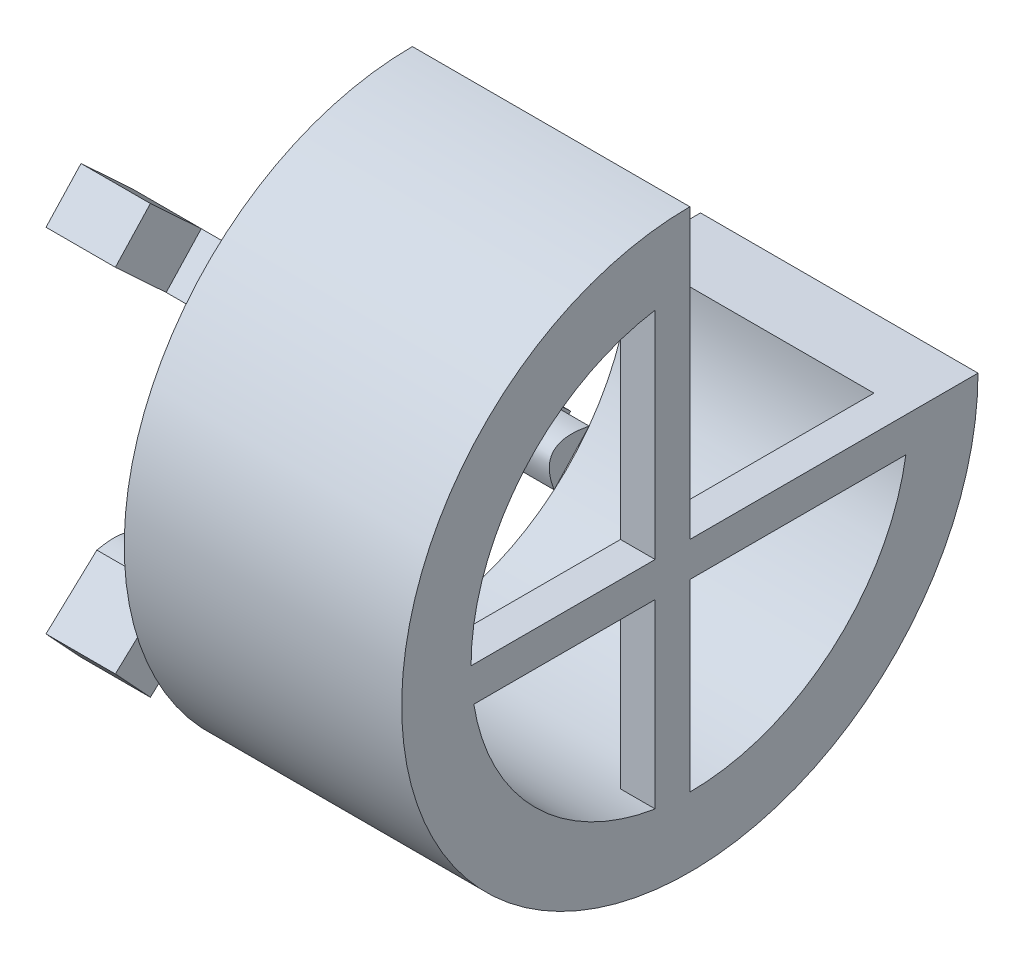
ISO-10303-21;
HEADER;
FILE_DESCRIPTION(('STEP AP214'),'2;1');
FILE_NAME('part.step','',(''),(''),'','','');
FILE_SCHEMA(('AUTOMOTIVE_DESIGN { 1 0 10303 214 1 1 1 1 }'));
ENDSEC;
DATA;
#1=APPLICATION_CONTEXT('core data for automotive mechanical design processes');
#2=APPLICATION_PROTOCOL_DEFINITION('international standard','automotive_design',2000,#1);
#3=PRODUCT_CONTEXT('',#1,'mechanical');
#4=PRODUCT('Part','Part','',(#3));
#5=PRODUCT_RELATED_PRODUCT_CATEGORY('part','',(#4));
#6=PRODUCT_DEFINITION_FORMATION('','',#4);
#7=PRODUCT_DEFINITION_CONTEXT('part definition',#1,'design');
#8=PRODUCT_DEFINITION('design','',#6,#7);
#9=PRODUCT_DEFINITION_SHAPE('','',#8);
#10=(LENGTH_UNIT() NAMED_UNIT(*) SI_UNIT(.MILLI.,.METRE.));
#11=(NAMED_UNIT(*) PLANE_ANGLE_UNIT() SI_UNIT($,.RADIAN.));
#12=(NAMED_UNIT(*) SI_UNIT($,.STERADIAN.) SOLID_ANGLE_UNIT());
#13=UNCERTAINTY_MEASURE_WITH_UNIT(LENGTH_MEASURE(1.E-05),#10,'distance_accuracy_value','');
#14=(GEOMETRIC_REPRESENTATION_CONTEXT(3) GLOBAL_UNCERTAINTY_ASSIGNED_CONTEXT((#13)) GLOBAL_UNIT_ASSIGNED_CONTEXT((#10,
#11,#12)) REPRESENTATION_CONTEXT('',''));
#15=CARTESIAN_POINT('',(0.,0.,0.));
#16=DIRECTION('',(0.,0.,1.));
#17=DIRECTION('',(1.,0.,0.));
#18=AXIS2_PLACEMENT_3D('',#15,#16,#17);
#19=CARTESIAN_POINT('',(-10.,-12.011358607731,-10.218618517025));
#20=DIRECTION('',(0.,-0.680138497092121,-0.733083641048735));
#21=DIRECTION('',(0.,0.733083641048735,-0.680138497092121));
#22=AXIS2_PLACEMENT_3D('',#19,#20,#21);
#23=PLANE('',#22);
#24=DIRECTION('',(1.,0.,0.));
#25=VECTOR('',#24,1.);
#26=CARTESIAN_POINT('',(-10.,-12.011358607731,-10.218618517025));
#27=LINE('',#26,#25);
#28=CARTESIAN_POINT('',(-5.,-12.011358607731,-10.218618517025));
#29=VERTEX_POINT('',#28);
#30=CARTESIAN_POINT('',(0.,-12.011358607731,-10.218618517025));
#31=VERTEX_POINT('',#30);
#32=EDGE_CURVE('E81',#29,#31,#27,.T.);
#33=ORIENTED_EDGE('',*,*,#32,.F.);
#34=DIRECTION('',(0.,-0.733083641048735,0.680138497092121));
#35=VECTOR('',#34,1.);
#36=CARTESIAN_POINT('',(-5.,-9.29124492297761,-12.7422787515123));
#37=LINE('',#36,#35);
#38=CARTESIAN_POINT('',(-5.,-9.2912449229776,-12.7422787515123));
#39=VERTEX_POINT('',#38);
#40=EDGE_CURVE('E92',#39,#29,#37,.T.);
#41=ORIENTED_EDGE('',*,*,#40,.F.);
#42=DIRECTION('',(1.,0.,0.));
#43=VECTOR('',#42,1.);
#44=CARTESIAN_POINT('',(-10.,-9.2912449229776,-12.7422787515123));
#45=LINE('',#44,#43);
#46=CARTESIAN_POINT('',(0.,-9.2912449229776,-12.7422787515123));
#47=VERTEX_POINT('',#46);
#48=EDGE_CURVE('E155',#39,#47,#45,.T.);
#49=ORIENTED_EDGE('',*,*,#48,.T.);
#50=CARTESIAN_POINT('',(0.,-12.011358607731,-10.218618517025));
#51=CARTESIAN_POINT('',(0.,-9.2912449229776,-12.7422787515123));
#52=B_SPLINE_CURVE_WITH_KNOTS('',1,(#50,#51),.UNSPECIFIED.,.F.,.F.,(2,2),(0.,1.),.UNSPECIFIED.);
#53=EDGE_CURVE('E142',#31,#47,#52,.T.);
#54=ORIENTED_EDGE('',*,*,#53,.F.);
#55=EDGE_LOOP('',(#33,#41,#49,#54));
#56=FACE_BOUND('',#55,.T.);
#57=ADVANCED_FACE('F73',(#56),#23,.T.);
#58=CARTESIAN_POINT('',(-10.,-9.2912449229776,-12.7422787515123));
#59=CARTESIAN_POINT('',(-10.,-8.49371861151528,-8.8660101936881));
#60=CARTESIAN_POINT('',(-10.,-12.011358607731,-10.218618517025));
#61=B_SPLINE_CURVE_WITH_KNOTS('',2,(#58,#59,#60),.UNSPECIFIED.,.F.,.F.,(3,3),(0.,1.),.UNSPECIFIED.);
#62=DIRECTION('',(1.,0.,0.));
#63=VECTOR('',#62,1.);
#64=SURFACE_OF_LINEAR_EXTRUSION('',#61,#63);
#65=CARTESIAN_POINT('',(0.,-9.2912449229776,-12.7422787515123));
#66=CARTESIAN_POINT('',(0.,-8.49371861151528,-8.8660101936881));
#67=CARTESIAN_POINT('',(0.,-12.011358607731,-10.218618517025));
#68=B_SPLINE_CURVE_WITH_KNOTS('',2,(#65,#66,#67),.UNSPECIFIED.,.F.,.F.,(3,3),(0.,1.),.UNSPECIFIED.);
#69=EDGE_CURVE('E145',#47,#31,#68,.T.);
#70=ORIENTED_EDGE('',*,*,#69,.F.);
#71=ORIENTED_EDGE('',*,*,#48,.F.);
#72=CARTESIAN_POINT('',(-10.,-9.29124492297761,-12.7422787515123));
#73=VERTEX_POINT('',#72);
#74=EDGE_CURVE('E256',#73,#39,#45,.T.);
#75=ORIENTED_EDGE('',*,*,#74,.F.);
#76=CARTESIAN_POINT('',(-10.,-12.011358607731,-10.218618517025));
#77=VERTEX_POINT('',#76);
#78=EDGE_CURVE('E140',#73,#77,#61,.T.);
#79=ORIENTED_EDGE('',*,*,#78,.T.);
#80=EDGE_CURVE('E13',#77,#29,#27,.T.);
#81=ORIENTED_EDGE('',*,*,#80,.T.);
#82=ORIENTED_EDGE('',*,*,#32,.T.);
#83=EDGE_LOOP('',(#70,#71,#75,#79,#81,#82));
#84=FACE_BOUND('',#83,.T.);
#85=ADVANCED_FACE('F162',(#84),#64,.T.);
#86=CARTESIAN_POINT('',(-10.,-9.57251018843479,-10.1732294139784));
#87=DIRECTION('',(-1.,0.,0.));
#88=DIRECTION('',(0.,0.,1.));
#89=AXIS2_PLACEMENT_3D('',#86,#87,#88);
#90=PLANE('',#89);
#91=ORIENTED_EDGE('',*,*,#78,.F.);
#92=DIRECTION('',(0.,0.680138497092121,0.733083641048735));
#93=VECTOR('',#92,1.);
#94=CARTESIAN_POINT('',(-10.,-12.6919374084382,-16.407696956756));
#95=LINE('',#94,#93);
#96=CARTESIAN_POINT('',(-10.,-12.6919374084382,-16.407696956756));
#97=VERTEX_POINT('',#96);
#98=EDGE_CURVE('E123',#97,#73,#95,.T.);
#99=ORIENTED_EDGE('',*,*,#98,.F.);
#100=DIRECTION('',(0.,0.733083641048735,-0.680138497092121));
#101=VECTOR('',#100,1.);
#102=CARTESIAN_POINT('',(-10.,-15.4120510931916,-13.8840367222687));
#103=LINE('',#102,#101);
#104=CARTESIAN_POINT('',(-10.,-15.4120510931916,-13.8840367222687));
#105=VERTEX_POINT('',#104);
#106=EDGE_CURVE('E129',#105,#97,#103,.T.);
#107=ORIENTED_EDGE('',*,*,#106,.F.);
#108=DIRECTION('',(0.,0.680138497092121,0.733083641048735));
#109=VECTOR('',#108,1.);
#110=CARTESIAN_POINT('',(-10.,-15.4120510931916,-13.8840367222687));
#111=LINE('',#110,#109);
#112=EDGE_CURVE('E150',#105,#77,#111,.T.);
#113=ORIENTED_EDGE('',*,*,#112,.T.);
#114=EDGE_LOOP('',(#91,#99,#107,#113));
#115=FACE_BOUND('',#114,.T.);
#116=ADVANCED_FACE('F139',(#115),#90,.T.);
#117=CARTESIAN_POINT('',(0.,-9.57251018843479,-10.1732294139784));
#118=DIRECTION('',(-1.,0.,0.));
#119=DIRECTION('',(0.,0.,1.));
#120=AXIS2_PLACEMENT_3D('',#117,#118,#119);
#121=PLANE('',#120);
#122=ORIENTED_EDGE('',*,*,#53,.T.);
#123=ORIENTED_EDGE('',*,*,#69,.T.);
#124=EDGE_LOOP('',(#122,#123));
#125=FACE_BOUND('',#124,.T.);
#126=ADVANCED_FACE('F166',(#125),#121,.F.);
#127=CARTESIAN_POINT('',(-10.,-12.6919374084382,-16.407696956756));
#128=DIRECTION('',(0.,-0.733083641048735,0.680138497092121));
#129=DIRECTION('',(0.,-0.680138497092121,-0.733083641048735));
#130=AXIS2_PLACEMENT_3D('',#127,#128,#129);
#131=PLANE('',#130);
#132=ORIENTED_EDGE('',*,*,#74,.T.);
#133=DIRECTION('',(0.,0.680138497092121,0.733083641048735));
#134=VECTOR('',#133,1.);
#135=CARTESIAN_POINT('',(-5.,-12.6919374084382,-16.407696956756));
#136=LINE('',#135,#134);
#137=CARTESIAN_POINT('',(-5.,-12.6919374084382,-16.407696956756));
#138=VERTEX_POINT('',#137);
#139=EDGE_CURVE('E125',#138,#39,#136,.T.);
#140=ORIENTED_EDGE('',*,*,#139,.F.);
#141=DIRECTION('',(1.,0.,0.));
#142=VECTOR('',#141,1.);
#143=CARTESIAN_POINT('',(-10.,-12.6919374084382,-16.407696956756));
#144=LINE('',#143,#142);
#145=EDGE_CURVE('E118',#97,#138,#144,.T.);
#146=ORIENTED_EDGE('',*,*,#145,.F.);
#147=ORIENTED_EDGE('',*,*,#98,.T.);
#148=EDGE_LOOP('',(#132,#140,#146,#147));
#149=FACE_BOUND('',#148,.T.);
#150=ADVANCED_FACE('F121',(#149),#131,.F.);
#151=CARTESIAN_POINT('',(-5.,-12.6919374084382,-16.407696956756));
#152=DIRECTION('',(-1.,0.,0.));
#153=DIRECTION('',(0.,0.,1.));
#154=AXIS2_PLACEMENT_3D('',#151,#152,#153);
#155=PLANE('',#154);
#156=ORIENTED_EDGE('',*,*,#40,.T.);
#157=DIRECTION('',(0.,0.680138497092121,0.733083641048735));
#158=VECTOR('',#157,1.);
#159=CARTESIAN_POINT('',(-5.,-15.4120510931916,-13.8840367222687));
#160=LINE('',#159,#158);
#161=CARTESIAN_POINT('',(-5.,-15.4120510931916,-13.8840367222687));
#162=VERTEX_POINT('',#161);
#163=EDGE_CURVE('E147',#162,#29,#160,.T.);
#164=ORIENTED_EDGE('',*,*,#163,.F.);
#165=DIRECTION('',(0.,-0.733083641048735,0.680138497092121));
#166=VECTOR('',#165,1.);
#167=CARTESIAN_POINT('',(-5.,-12.6919374084382,-16.407696956756));
#168=LINE('',#167,#166);
#169=EDGE_CURVE('E128',#138,#162,#168,.T.);
#170=ORIENTED_EDGE('',*,*,#169,.F.);
#171=ORIENTED_EDGE('',*,*,#139,.T.);
#172=EDGE_LOOP('',(#156,#164,#170,#171));
#173=FACE_BOUND('',#172,.T.);
#174=ADVANCED_FACE('F174',(#173),#155,.F.);
#175=CARTESIAN_POINT('',(-5.,-15.4120510931916,-13.8840367222687));
#176=DIRECTION('',(0.,0.733083641048735,-0.680138497092121));
#177=DIRECTION('',(0.,0.680138497092121,0.733083641048735));
#178=AXIS2_PLACEMENT_3D('',#175,#176,#177);
#179=PLANE('',#178);
#180=ORIENTED_EDGE('',*,*,#80,.F.);
#181=ORIENTED_EDGE('',*,*,#112,.F.);
#182=DIRECTION('',(-1.,0.,0.));
#183=VECTOR('',#182,1.);
#184=CARTESIAN_POINT('',(-5.,-15.4120510931916,-13.8840367222687));
#185=LINE('',#184,#183);
#186=EDGE_CURVE('E134',#162,#105,#185,.T.);
#187=ORIENTED_EDGE('',*,*,#186,.F.);
#188=ORIENTED_EDGE('',*,*,#163,.T.);
#189=EDGE_LOOP('',(#180,#181,#187,#188));
#190=FACE_BOUND('',#189,.T.);
#191=ADVANCED_FACE('F177',(#190),#179,.F.);
#192=CARTESIAN_POINT('',(0.,-14.0519942508149,-15.1458668395123));
#193=DIRECTION('',(0.,-0.680138497092121,-0.733083641048735));
#194=DIRECTION('',(0.,0.733083641048735,-0.680138497092121));
#195=AXIS2_PLACEMENT_3D('',#192,#193,#194);
#196=PLANE('',#195);
#197=ORIENTED_EDGE('',*,*,#106,.T.);
#198=ORIENTED_EDGE('',*,*,#145,.T.);
#199=ORIENTED_EDGE('',*,*,#169,.T.);
#200=ORIENTED_EDGE('',*,*,#186,.T.);
#201=EDGE_LOOP('',(#197,#198,#199,#200));
#202=FACE_BOUND('',#201,.T.);
#203=ADVANCED_FACE('F132',(#202),#196,.T.);
#204=CLOSED_SHELL('',(#57,#85,#116,#126,#150,#174,#191,#203));
#205=MANIFOLD_SOLID_BREP('B2',#204);
#206=CARTESIAN_POINT('',(-10.,-9.29124492297761,12.7422787515123));
#207=DIRECTION('',(0.,-0.680138497092121,0.733083641048735));
#208=DIRECTION('',(0.,-0.733083641048735,-0.680138497092121));
#209=AXIS2_PLACEMENT_3D('',#206,#207,#208);
#210=PLANE('',#209);
#211=DIRECTION('',(1.,0.,0.));
#212=VECTOR('',#211,1.);
#213=CARTESIAN_POINT('',(-10.,-9.29124492297761,12.7422787515123));
#214=LINE('',#213,#212);
#215=CARTESIAN_POINT('',(-5.,-9.29124492297761,12.7422787515123));
#216=VERTEX_POINT('',#215);
#217=CARTESIAN_POINT('',(0.,-9.29124492297761,12.7422787515123));
#218=VERTEX_POINT('',#217);
#219=EDGE_CURVE('E285',#216,#218,#214,.T.);
#220=ORIENTED_EDGE('',*,*,#219,.F.);
#221=DIRECTION('',(0.,0.733083641048735,0.680138497092121));
#222=VECTOR('',#221,1.);
#223=CARTESIAN_POINT('',(-5.,-12.011358607731,10.218618517025));
#224=LINE('',#223,#222);
#225=CARTESIAN_POINT('',(-5.,-12.011358607731,10.218618517025));
#226=VERTEX_POINT('',#225);
#227=EDGE_CURVE('E296',#226,#216,#224,.T.);
#228=ORIENTED_EDGE('',*,*,#227,.F.);
#229=DIRECTION('',(1.,0.,0.));
#230=VECTOR('',#229,1.);
#231=CARTESIAN_POINT('',(-10.,-12.011358607731,10.218618517025));
#232=LINE('',#231,#230);
#233=CARTESIAN_POINT('',(0.,-12.011358607731,10.218618517025));
#234=VERTEX_POINT('',#233);
#235=EDGE_CURVE('E359',#226,#234,#232,.T.);
#236=ORIENTED_EDGE('',*,*,#235,.T.);
#237=CARTESIAN_POINT('',(0.,-9.29124492297761,12.7422787515123));
#238=CARTESIAN_POINT('',(0.,-12.011358607731,10.218618517025));
#239=B_SPLINE_CURVE_WITH_KNOTS('',1,(#237,#238),.UNSPECIFIED.,.F.,.F.,(2,2),(0.,1.),.UNSPECIFIED.);
#240=EDGE_CURVE('E346',#218,#234,#239,.T.);
#241=ORIENTED_EDGE('',*,*,#240,.F.);
#242=EDGE_LOOP('',(#220,#228,#236,#241));
#243=FACE_BOUND('',#242,.T.);
#244=ADVANCED_FACE('F277',(#243),#210,.T.);
#245=CARTESIAN_POINT('',(-10.,-12.011358607731,10.218618517025));
#246=CARTESIAN_POINT('',(-10.,-8.49371861151528,8.86601019368809));
#247=CARTESIAN_POINT('',(-10.,-9.29124492297761,12.7422787515123));
#248=B_SPLINE_CURVE_WITH_KNOTS('',2,(#245,#246,#247),.UNSPECIFIED.,.F.,.F.,(3,3),(0.,1.),.UNSPECIFIED.);
#249=DIRECTION('',(1.,0.,0.));
#250=VECTOR('',#249,1.);
#251=SURFACE_OF_LINEAR_EXTRUSION('',#248,#250);
#252=CARTESIAN_POINT('',(0.,-12.011358607731,10.218618517025));
#253=CARTESIAN_POINT('',(0.,-8.49371861151528,8.86601019368809));
#254=CARTESIAN_POINT('',(0.,-9.29124492297761,12.7422787515123));
#255=B_SPLINE_CURVE_WITH_KNOTS('',2,(#252,#253,#254),.UNSPECIFIED.,.F.,.F.,(3,3),(0.,1.),.UNSPECIFIED.);
#256=EDGE_CURVE('E349',#234,#218,#255,.T.);
#257=ORIENTED_EDGE('',*,*,#256,.F.);
#258=ORIENTED_EDGE('',*,*,#235,.F.);
#259=CARTESIAN_POINT('',(-10.,-12.011358607731,10.218618517025));
#260=VERTEX_POINT('',#259);
#261=EDGE_CURVE('E460',#260,#226,#232,.T.);
#262=ORIENTED_EDGE('',*,*,#261,.F.);
#263=CARTESIAN_POINT('',(-10.,-9.29124492297761,12.7422787515123));
#264=VERTEX_POINT('',#263);
#265=EDGE_CURVE('E344',#260,#264,#248,.T.);
#266=ORIENTED_EDGE('',*,*,#265,.T.);
#267=EDGE_CURVE('E71',#264,#216,#214,.T.);
#268=ORIENTED_EDGE('',*,*,#267,.T.);
#269=ORIENTED_EDGE('',*,*,#219,.T.);
#270=EDGE_LOOP('',(#257,#258,#262,#266,#268,#269));
#271=FACE_BOUND('',#270,.T.);
#272=ADVANCED_FACE('F366',(#271),#251,.T.);
#273=CARTESIAN_POINT('',(-10.,-9.57251018843479,10.1732294139784));
#274=DIRECTION('',(1.,0.,0.));
#275=DIRECTION('',(0.,0.,-1.));
#276=AXIS2_PLACEMENT_3D('',#273,#274,#275);
#277=PLANE('',#276);
#278=ORIENTED_EDGE('',*,*,#265,.F.);
#279=DIRECTION('',(0.,0.680138497092121,-0.733083641048735));
#280=VECTOR('',#279,1.);
#281=CARTESIAN_POINT('',(-10.,-15.4120510931916,13.8840367222687));
#282=LINE('',#281,#280);
#283=CARTESIAN_POINT('',(-10.,-15.4120510931916,13.8840367222687));
#284=VERTEX_POINT('',#283);
#285=EDGE_CURVE('E327',#284,#260,#282,.T.);
#286=ORIENTED_EDGE('',*,*,#285,.F.);
#287=DIRECTION('',(0.,-0.733083641048735,-0.680138497092121));
#288=VECTOR('',#287,1.);
#289=CARTESIAN_POINT('',(-10.,-12.6919374084382,16.407696956756));
#290=LINE('',#289,#288);
#291=CARTESIAN_POINT('',(-10.,-12.6919374084382,16.407696956756));
#292=VERTEX_POINT('',#291);
#293=EDGE_CURVE('E333',#292,#284,#290,.T.);
#294=ORIENTED_EDGE('',*,*,#293,.F.);
#295=DIRECTION('',(0.,0.680138497092121,-0.733083641048735));
#296=VECTOR('',#295,1.);
#297=CARTESIAN_POINT('',(-10.,-12.6919374084382,16.407696956756));
#298=LINE('',#297,#296);
#299=EDGE_CURVE('E354',#292,#264,#298,.T.);
#300=ORIENTED_EDGE('',*,*,#299,.T.);
#301=EDGE_LOOP('',(#278,#286,#294,#300));
#302=FACE_BOUND('',#301,.T.);
#303=ADVANCED_FACE('F343',(#302),#277,.F.);
#304=CARTESIAN_POINT('',(0.,-9.57251018843479,10.1732294139784));
#305=DIRECTION('',(1.,0.,0.));
#306=DIRECTION('',(0.,0.,-1.));
#307=AXIS2_PLACEMENT_3D('',#304,#305,#306);
#308=PLANE('',#307);
#309=ORIENTED_EDGE('',*,*,#240,.T.);
#310=ORIENTED_EDGE('',*,*,#256,.T.);
#311=EDGE_LOOP('',(#309,#310));
#312=FACE_BOUND('',#311,.T.);
#313=ADVANCED_FACE('F370',(#312),#308,.T.);
#314=CARTESIAN_POINT('',(-10.,-15.4120510931916,13.8840367222687));
#315=DIRECTION('',(0.,0.733083641048735,0.680138497092121));
#316=DIRECTION('',(0.,-0.680138497092121,0.733083641048735));
#317=AXIS2_PLACEMENT_3D('',#314,#315,#316);
#318=PLANE('',#317);
#319=ORIENTED_EDGE('',*,*,#261,.T.);
#320=DIRECTION('',(0.,0.680138497092121,-0.733083641048735));
#321=VECTOR('',#320,1.);
#322=CARTESIAN_POINT('',(-5.,-15.4120510931916,13.8840367222687));
#323=LINE('',#322,#321);
#324=CARTESIAN_POINT('',(-5.,-15.4120510931916,13.8840367222687));
#325=VERTEX_POINT('',#324);
#326=EDGE_CURVE('E329',#325,#226,#323,.T.);
#327=ORIENTED_EDGE('',*,*,#326,.F.);
#328=DIRECTION('',(1.,0.,0.));
#329=VECTOR('',#328,1.);
#330=CARTESIAN_POINT('',(-10.,-15.4120510931916,13.8840367222687));
#331=LINE('',#330,#329);
#332=EDGE_CURVE('E322',#284,#325,#331,.T.);
#333=ORIENTED_EDGE('',*,*,#332,.F.);
#334=ORIENTED_EDGE('',*,*,#285,.T.);
#335=EDGE_LOOP('',(#319,#327,#333,#334));
#336=FACE_BOUND('',#335,.T.);
#337=ADVANCED_FACE('F325',(#336),#318,.F.);
#338=CARTESIAN_POINT('',(-5.,-15.4120510931916,13.8840367222687));
#339=DIRECTION('',(-1.,0.,0.));
#340=DIRECTION('',(0.,0.,1.));
#341=AXIS2_PLACEMENT_3D('',#338,#339,#340);
#342=PLANE('',#341);
#343=ORIENTED_EDGE('',*,*,#227,.T.);
#344=DIRECTION('',(0.,0.680138497092121,-0.733083641048735));
#345=VECTOR('',#344,1.);
#346=CARTESIAN_POINT('',(-5.,-12.6919374084382,16.407696956756));
#347=LINE('',#346,#345);
#348=CARTESIAN_POINT('',(-5.,-12.6919374084382,16.407696956756));
#349=VERTEX_POINT('',#348);
#350=EDGE_CURVE('E351',#349,#216,#347,.T.);
#351=ORIENTED_EDGE('',*,*,#350,.F.);
#352=DIRECTION('',(0.,0.733083641048735,0.680138497092121));
#353=VECTOR('',#352,1.);
#354=CARTESIAN_POINT('',(-5.,-15.4120510931916,13.8840367222687));
#355=LINE('',#354,#353);
#356=EDGE_CURVE('E332',#325,#349,#355,.T.);
#357=ORIENTED_EDGE('',*,*,#356,.F.);
#358=ORIENTED_EDGE('',*,*,#326,.T.);
#359=EDGE_LOOP('',(#343,#351,#357,#358));
#360=FACE_BOUND('',#359,.T.);
#361=ADVANCED_FACE('F378',(#360),#342,.F.);
#362=CARTESIAN_POINT('',(-5.,-12.6919374084382,16.407696956756));
#363=DIRECTION('',(0.,-0.733083641048735,-0.680138497092121));
#364=DIRECTION('',(0.,0.680138497092121,-0.733083641048735));
#365=AXIS2_PLACEMENT_3D('',#362,#363,#364);
#366=PLANE('',#365);
#367=ORIENTED_EDGE('',*,*,#267,.F.);
#368=ORIENTED_EDGE('',*,*,#299,.F.);
#369=DIRECTION('',(-1.,0.,0.));
#370=VECTOR('',#369,1.);
#371=CARTESIAN_POINT('',(-5.,-12.6919374084382,16.407696956756));
#372=LINE('',#371,#370);
#373=EDGE_CURVE('E338',#349,#292,#372,.T.);
#374=ORIENTED_EDGE('',*,*,#373,.F.);
#375=ORIENTED_EDGE('',*,*,#350,.T.);
#376=EDGE_LOOP('',(#367,#368,#374,#375));
#377=FACE_BOUND('',#376,.T.);
#378=ADVANCED_FACE('F381',(#377),#366,.F.);
#379=CARTESIAN_POINT('',(0.,-14.0519942508149,15.1458668395123));
#380=DIRECTION('',(0.,-0.680138497092121,0.733083641048735));
#381=DIRECTION('',(0.,-0.733083641048735,-0.680138497092121));
#382=AXIS2_PLACEMENT_3D('',#379,#380,#381);
#383=PLANE('',#382);
#384=ORIENTED_EDGE('',*,*,#293,.T.);
#385=ORIENTED_EDGE('',*,*,#332,.T.);
#386=ORIENTED_EDGE('',*,*,#356,.T.);
#387=ORIENTED_EDGE('',*,*,#373,.T.);
#388=EDGE_LOOP('',(#384,#385,#386,#387));
#389=FACE_BOUND('',#388,.T.);
#390=ADVANCED_FACE('F336',(#389),#383,.T.);
#391=CLOSED_SHELL('',(#244,#272,#303,#313,#337,#361,#378,#390));
#392=MANIFOLD_SOLID_BREP('B7',#391);
#393=CARTESIAN_POINT('',(-10.,12.011358607731,10.218618517025));
#394=DIRECTION('',(0.,0.68013849709212,0.733083641048736));
#395=DIRECTION('',(0.,-0.733083641048736,0.68013849709212));
#396=AXIS2_PLACEMENT_3D('',#393,#394,#395);
#397=PLANE('',#396);
#398=DIRECTION('',(1.,0.,0.));
#399=VECTOR('',#398,1.);
#400=CARTESIAN_POINT('',(-10.,12.011358607731,10.218618517025));
#401=LINE('',#400,#399);
#402=CARTESIAN_POINT('',(-5.,12.011358607731,10.218618517025));
#403=VERTEX_POINT('',#402);
#404=CARTESIAN_POINT('',(0.,12.011358607731,10.218618517025));
#405=VERTEX_POINT('',#404);
#406=EDGE_CURVE('E488',#403,#405,#401,.T.);
#407=ORIENTED_EDGE('',*,*,#406,.F.);
#408=DIRECTION('',(0.,0.733083641048736,-0.68013849709212));
#409=VECTOR('',#408,1.);
#410=CARTESIAN_POINT('',(-5.,9.2912449229776,12.7422787515123));
#411=LINE('',#410,#409);
#412=CARTESIAN_POINT('',(-5.,9.2912449229776,12.7422787515123));
#413=VERTEX_POINT('',#412);
#414=EDGE_CURVE('E499',#413,#403,#411,.T.);
#415=ORIENTED_EDGE('',*,*,#414,.F.);
#416=DIRECTION('',(1.,0.,0.));
#417=VECTOR('',#416,1.);
#418=CARTESIAN_POINT('',(-10.,9.2912449229776,12.7422787515123));
#419=LINE('',#418,#417);
#420=CARTESIAN_POINT('',(0.,9.2912449229776,12.7422787515123));
#421=VERTEX_POINT('',#420);
#422=EDGE_CURVE('E562',#413,#421,#419,.T.);
#423=ORIENTED_EDGE('',*,*,#422,.T.);
#424=CARTESIAN_POINT('',(0.,12.011358607731,10.218618517025));
#425=CARTESIAN_POINT('',(0.,9.2912449229776,12.7422787515123));
#426=B_SPLINE_CURVE_WITH_KNOTS('',1,(#424,#425),.UNSPECIFIED.,.F.,.F.,(2,2),(0.,1.),.UNSPECIFIED.);
#427=EDGE_CURVE('E549',#405,#421,#426,.T.);
#428=ORIENTED_EDGE('',*,*,#427,.F.);
#429=EDGE_LOOP('',(#407,#415,#423,#428));
#430=FACE_BOUND('',#429,.T.);
#431=ADVANCED_FACE('F480',(#430),#397,.T.);
#432=CARTESIAN_POINT('',(-10.,9.2912449229776,12.7422787515123));
#433=CARTESIAN_POINT('',(-10.,8.49371861151528,8.8660101936881));
#434=CARTESIAN_POINT('',(-10.,12.011358607731,10.218618517025));
#435=B_SPLINE_CURVE_WITH_KNOTS('',2,(#432,#433,#434),.UNSPECIFIED.,.F.,.F.,(3,3),(0.,1.),.UNSPECIFIED.);
#436=DIRECTION('',(1.,0.,0.));
#437=VECTOR('',#436,1.);
#438=SURFACE_OF_LINEAR_EXTRUSION('',#435,#437);
#439=CARTESIAN_POINT('',(0.,9.2912449229776,12.7422787515123));
#440=CARTESIAN_POINT('',(0.,8.49371861151528,8.8660101936881));
#441=CARTESIAN_POINT('',(0.,12.011358607731,10.218618517025));
#442=B_SPLINE_CURVE_WITH_KNOTS('',2,(#439,#440,#441),.UNSPECIFIED.,.F.,.F.,(3,3),(0.,1.),.UNSPECIFIED.);
#443=EDGE_CURVE('E552',#421,#405,#442,.T.);
#444=ORIENTED_EDGE('',*,*,#443,.F.);
#445=ORIENTED_EDGE('',*,*,#422,.F.);
#446=CARTESIAN_POINT('',(-10.,9.2912449229776,12.7422787515123));
#447=VERTEX_POINT('',#446);
#448=EDGE_CURVE('E663',#447,#413,#419,.T.);
#449=ORIENTED_EDGE('',*,*,#448,.F.);
#450=CARTESIAN_POINT('',(-10.,12.011358607731,10.218618517025));
#451=VERTEX_POINT('',#450);
#452=EDGE_CURVE('E547',#447,#451,#435,.T.);
#453=ORIENTED_EDGE('',*,*,#452,.T.);
#454=EDGE_CURVE('E275',#451,#403,#401,.T.);
#455=ORIENTED_EDGE('',*,*,#454,.T.);
#456=ORIENTED_EDGE('',*,*,#406,.T.);
#457=EDGE_LOOP('',(#444,#445,#449,#453,#455,#456));
#458=FACE_BOUND('',#457,.T.);
#459=ADVANCED_FACE('F569',(#458),#438,.T.);
#460=CARTESIAN_POINT('',(-10.,9.57251018843478,10.1732294139784));
#461=DIRECTION('',(-1.,0.,0.));
#462=DIRECTION('',(0.,0.,1.));
#463=AXIS2_PLACEMENT_3D('',#460,#461,#462);
#464=PLANE('',#463);
#465=ORIENTED_EDGE('',*,*,#452,.F.);
#466=DIRECTION('',(0.,-0.68013849709212,-0.733083641048736));
#467=VECTOR('',#466,1.);
#468=CARTESIAN_POINT('',(-10.,12.6919374084382,16.407696956756));
#469=LINE('',#468,#467);
#470=CARTESIAN_POINT('',(-10.,12.6919374084382,16.407696956756));
#471=VERTEX_POINT('',#470);
#472=EDGE_CURVE('E530',#471,#447,#469,.T.);
#473=ORIENTED_EDGE('',*,*,#472,.F.);
#474=DIRECTION('',(0.,-0.733083641048736,0.680138497092121));
#475=VECTOR('',#474,1.);
#476=CARTESIAN_POINT('',(-10.,15.4120510931916,13.8840367222687));
#477=LINE('',#476,#475);
#478=CARTESIAN_POINT('',(-10.,15.4120510931916,13.8840367222687));
#479=VERTEX_POINT('',#478);
#480=EDGE_CURVE('E536',#479,#471,#477,.T.);
#481=ORIENTED_EDGE('',*,*,#480,.F.);
#482=DIRECTION('',(0.,-0.68013849709212,-0.733083641048736));
#483=VECTOR('',#482,1.);
#484=CARTESIAN_POINT('',(-10.,15.4120510931916,13.8840367222687));
#485=LINE('',#484,#483);
#486=EDGE_CURVE('E557',#479,#451,#485,.T.);
#487=ORIENTED_EDGE('',*,*,#486,.T.);
#488=EDGE_LOOP('',(#465,#473,#481,#487));
#489=FACE_BOUND('',#488,.T.);
#490=ADVANCED_FACE('F546',(#489),#464,.T.);
#491=CARTESIAN_POINT('',(0.,9.57251018843478,10.1732294139784));
#492=DIRECTION('',(-1.,0.,0.));
#493=DIRECTION('',(0.,0.,1.));
#494=AXIS2_PLACEMENT_3D('',#491,#492,#493);
#495=PLANE('',#494);
#496=ORIENTED_EDGE('',*,*,#427,.T.);
#497=ORIENTED_EDGE('',*,*,#443,.T.);
#498=EDGE_LOOP('',(#496,#497));
#499=FACE_BOUND('',#498,.T.);
#500=ADVANCED_FACE('F573',(#499),#495,.F.);
#501=CARTESIAN_POINT('',(-10.,12.6919374084382,16.407696956756));
#502=DIRECTION('',(0.,0.733083641048736,-0.68013849709212));
#503=DIRECTION('',(0.,0.68013849709212,0.733083641048736));
#504=AXIS2_PLACEMENT_3D('',#501,#502,#503);
#505=PLANE('',#504);
#506=ORIENTED_EDGE('',*,*,#448,.T.);
#507=DIRECTION('',(0.,-0.68013849709212,-0.733083641048736));
#508=VECTOR('',#507,1.);
#509=CARTESIAN_POINT('',(-5.,12.6919374084382,16.407696956756));
#510=LINE('',#509,#508);
#511=CARTESIAN_POINT('',(-5.,12.6919374084382,16.407696956756));
#512=VERTEX_POINT('',#511);
#513=EDGE_CURVE('E532',#512,#413,#510,.T.);
#514=ORIENTED_EDGE('',*,*,#513,.F.);
#515=DIRECTION('',(1.,0.,0.));
#516=VECTOR('',#515,1.);
#517=CARTESIAN_POINT('',(-10.,12.6919374084382,16.407696956756));
#518=LINE('',#517,#516);
#519=EDGE_CURVE('E525',#471,#512,#518,.T.);
#520=ORIENTED_EDGE('',*,*,#519,.F.);
#521=ORIENTED_EDGE('',*,*,#472,.T.);
#522=EDGE_LOOP('',(#506,#514,#520,#521));
#523=FACE_BOUND('',#522,.T.);
#524=ADVANCED_FACE('F528',(#523),#505,.F.);
#525=CARTESIAN_POINT('',(-5.,12.6919374084382,16.407696956756));
#526=DIRECTION('',(-1.,0.,0.));
#527=DIRECTION('',(0.,0.,1.));
#528=AXIS2_PLACEMENT_3D('',#525,#526,#527);
#529=PLANE('',#528);
#530=ORIENTED_EDGE('',*,*,#414,.T.);
#531=DIRECTION('',(0.,-0.68013849709212,-0.733083641048736));
#532=VECTOR('',#531,1.);
#533=CARTESIAN_POINT('',(-5.,15.4120510931916,13.8840367222686));
#534=LINE('',#533,#532);
#535=CARTESIAN_POINT('',(-5.,15.4120510931916,13.8840367222686));
#536=VERTEX_POINT('',#535);
#537=EDGE_CURVE('E554',#536,#403,#534,.T.);
#538=ORIENTED_EDGE('',*,*,#537,.F.);
#539=DIRECTION('',(0.,0.733083641048736,-0.68013849709212));
#540=VECTOR('',#539,1.);
#541=CARTESIAN_POINT('',(-5.,12.6919374084382,16.407696956756));
#542=LINE('',#541,#540);
#543=EDGE_CURVE('E535',#512,#536,#542,.T.);
#544=ORIENTED_EDGE('',*,*,#543,.F.);
#545=ORIENTED_EDGE('',*,*,#513,.T.);
#546=EDGE_LOOP('',(#530,#538,#544,#545));
#547=FACE_BOUND('',#546,.T.);
#548=ADVANCED_FACE('F581',(#547),#529,.F.);
#549=CARTESIAN_POINT('',(-5.,15.4120510931916,13.8840367222686));
#550=DIRECTION('',(0.,-0.733083641048736,0.68013849709212));
#551=DIRECTION('',(0.,-0.68013849709212,-0.733083641048736));
#552=AXIS2_PLACEMENT_3D('',#549,#550,#551);
#553=PLANE('',#552);
#554=ORIENTED_EDGE('',*,*,#454,.F.);
#555=ORIENTED_EDGE('',*,*,#486,.F.);
#556=DIRECTION('',(-1.,0.,0.));
#557=VECTOR('',#556,1.);
#558=CARTESIAN_POINT('',(-5.,15.4120510931916,13.8840367222686));
#559=LINE('',#558,#557);
#560=EDGE_CURVE('E541',#536,#479,#559,.T.);
#561=ORIENTED_EDGE('',*,*,#560,.F.);
#562=ORIENTED_EDGE('',*,*,#537,.T.);
#563=EDGE_LOOP('',(#554,#555,#561,#562));
#564=FACE_BOUND('',#563,.T.);
#565=ADVANCED_FACE('F584',(#564),#553,.F.);
#566=CARTESIAN_POINT('',(0.,14.0519942508149,15.1458668395123));
#567=DIRECTION('',(0.,0.680138497092121,0.733083641048736));
#568=DIRECTION('',(0.,-0.733083641048736,0.680138497092121));
#569=AXIS2_PLACEMENT_3D('',#566,#567,#568);
#570=PLANE('',#569);
#571=ORIENTED_EDGE('',*,*,#480,.T.);
#572=ORIENTED_EDGE('',*,*,#519,.T.);
#573=ORIENTED_EDGE('',*,*,#543,.T.);
#574=ORIENTED_EDGE('',*,*,#560,.T.);
#575=EDGE_LOOP('',(#571,#572,#573,#574));
#576=FACE_BOUND('',#575,.T.);
#577=ADVANCED_FACE('F539',(#576),#570,.T.);
#578=CLOSED_SHELL('',(#431,#459,#490,#500,#524,#548,#565,#577));
#579=MANIFOLD_SOLID_BREP('B65',#578);
#580=CARTESIAN_POINT('',(-37.2885406064845,0.,0.));
#581=DIRECTION('',(-1.,0.,0.));
#582=DIRECTION('',(0.,0.,1.));
#583=AXIS2_PLACEMENT_3D('',#580,#581,#582);
#584=CYLINDRICAL_SURFACE('',#583,15.77);
#585=CARTESIAN_POINT('',(20.,0.,0.));
#586=DIRECTION('',(-1.,0.,0.));
#587=DIRECTION('',(0.,0.,1.));
#588=AXIS2_PLACEMENT_3D('',#585,#586,#587);
#589=CIRCLE('',#588,15.77);
#590=CARTESIAN_POINT('',(20.,-1.01392618080005E-13,15.77));
#591=VERTEX_POINT('',#590);
#592=CARTESIAN_POINT('',(20.,15.5705780239528,2.49999999999993));
#593=VERTEX_POINT('',#592);
#594=EDGE_CURVE('E678',#591,#593,#589,.T.);
#595=ORIENTED_EDGE('',*,*,#594,.F.);
#596=DIRECTION('',(-1.,0.,0.));
#597=VECTOR('',#596,1.);
#598=CARTESIAN_POINT('',(-37.2885406064845,-1.01392618080005E-13,15.77));
#599=LINE('',#598,#597);
#600=CARTESIAN_POINT('',(17.5,-1.01392618080005E-13,15.77));
#601=VERTEX_POINT('',#600);
#602=EDGE_CURVE('E843',#591,#601,#599,.T.);
#603=ORIENTED_EDGE('',*,*,#602,.T.);
#604=CARTESIAN_POINT('',(17.5,0.,0.));
#605=DIRECTION('',(-1.,0.,0.));
#606=DIRECTION('',(0.,0.,1.));
#607=AXIS2_PLACEMENT_3D('',#604,#605,#606);
#608=CIRCLE('',#607,15.77);
#609=CARTESIAN_POINT('',(17.5,-2.49999999999997,15.5705780239527));
#610=VERTEX_POINT('',#609);
#611=EDGE_CURVE('E831',#601,#610,#608,.F.);
#612=ORIENTED_EDGE('',*,*,#611,.T.);
#613=DIRECTION('',(-1.,0.,0.));
#614=VECTOR('',#613,1.);
#615=CARTESIAN_POINT('',(-37.2885406064845,-2.49999999999997,15.5705780239527));
#616=LINE('',#615,#614);
#617=CARTESIAN_POINT('',(20.,-2.49999999999997,15.5705780239527));
#618=VERTEX_POINT('',#617);
#619=EDGE_CURVE('E840',#610,#618,#616,.F.);
#620=ORIENTED_EDGE('',*,*,#619,.T.);
#621=CARTESIAN_POINT('',(20.,-15.5705780239528,2.49999999999993));
#622=VERTEX_POINT('',#621);
#623=EDGE_CURVE('E683',#622,#618,#589,.T.);
#624=ORIENTED_EDGE('',*,*,#623,.F.);
#625=DIRECTION('',(-1.,0.,0.));
#626=VECTOR('',#625,1.);
#627=CARTESIAN_POINT('',(-37.2885406064845,-15.5705780239528,2.49999999999993));
#628=LINE('',#627,#626);
#629=CARTESIAN_POINT('',(17.5,-15.5705780239528,2.49999999999993));
#630=VERTEX_POINT('',#629);
#631=EDGE_CURVE('E838',#622,#630,#628,.T.);
#632=ORIENTED_EDGE('',*,*,#631,.T.);
#633=CARTESIAN_POINT('',(17.5,-15.77,-1.91368092181992E-13));
#634=VERTEX_POINT('',#633);
#635=EDGE_CURVE('E1053',#630,#634,#608,.F.);
#636=ORIENTED_EDGE('',*,*,#635,.T.);
#637=DIRECTION('',(-1.,0.,0.));
#638=VECTOR('',#637,1.);
#639=CARTESIAN_POINT('',(-37.2885406064845,-15.77,-1.91368092181992E-13));
#640=LINE('',#639,#638);
#641=CARTESIAN_POINT('',(20.,-15.77,-1.90143846580897E-13));
#642=VERTEX_POINT('',#641);
#643=EDGE_CURVE('E835',#642,#634,#640,.T.);
#644=ORIENTED_EDGE('',*,*,#643,.F.);
#645=CARTESIAN_POINT('',(20.,-2.49999999999997,-15.5705780239527));
#646=VERTEX_POINT('',#645);
#647=EDGE_CURVE('E478',#646,#642,#589,.T.);
#648=ORIENTED_EDGE('',*,*,#647,.F.);
#649=DIRECTION('',(-1.,0.,0.));
#650=VECTOR('',#649,1.);
#651=CARTESIAN_POINT('',(-37.2885406064845,-2.49999999999997,-15.5705780239527));
#652=LINE('',#651,#650);
#653=CARTESIAN_POINT('',(17.5,-2.49999999999997,-15.5705780239527));
#654=VERTEX_POINT('',#653);
#655=EDGE_CURVE('E846',#646,#654,#652,.T.);
#656=ORIENTED_EDGE('',*,*,#655,.T.);
#657=CARTESIAN_POINT('',(17.5,1.65181982140669E-13,-15.77));
#658=VERTEX_POINT('',#657);
#659=EDGE_CURVE('E830',#654,#658,#608,.F.);
#660=ORIENTED_EDGE('',*,*,#659,.T.);
#661=DIRECTION('',(1.,0.,0.));
#662=VECTOR('',#661,1.);
#663=CARTESIAN_POINT('',(20.,1.65181982140669E-13,-15.77));
#664=LINE('',#663,#662);
#665=CARTESIAN_POINT('',(0.,1.65181982140669E-13,-15.77));
#666=VERTEX_POINT('',#665);
#667=EDGE_CURVE('E801',#666,#658,#664,.T.);
#668=ORIENTED_EDGE('',*,*,#667,.F.);
#669=CARTESIAN_POINT('',(0.,0.,0.));
#670=DIRECTION('',(-1.,0.,0.));
#671=DIRECTION('',(0.,0.,1.));
#672=AXIS2_PLACEMENT_3D('',#669,#670,#671);
#673=CIRCLE('',#672,15.77);
#674=CARTESIAN_POINT('',(0.,-9.29124492297761,-12.7422787515123));
#675=VERTEX_POINT('',#674);
#676=EDGE_CURVE('E861',#666,#675,#673,.T.);
#677=ORIENTED_EDGE('',*,*,#676,.T.);
#678=CARTESIAN_POINT('',(0.,-12.011358607731,-10.218618517025));
#679=VERTEX_POINT('',#678);
#680=EDGE_CURVE('E694',#675,#679,#673,.T.);
#681=ORIENTED_EDGE('',*,*,#680,.T.);
#682=CARTESIAN_POINT('',(0.,-12.011358607731,10.218618517025));
#683=VERTEX_POINT('',#682);
#684=EDGE_CURVE('E690',#679,#683,#673,.T.);
#685=ORIENTED_EDGE('',*,*,#684,.T.);
#686=CARTESIAN_POINT('',(0.,-9.29124492297762,12.7422787515123));
#687=VERTEX_POINT('',#686);
#688=EDGE_CURVE('E923',#683,#687,#673,.T.);
#689=ORIENTED_EDGE('',*,*,#688,.T.);
#690=CARTESIAN_POINT('',(0.,9.29124492297761,12.7422787515123));
#691=VERTEX_POINT('',#690);
#692=EDGE_CURVE('E924',#687,#691,#673,.T.);
#693=ORIENTED_EDGE('',*,*,#692,.T.);
#694=CARTESIAN_POINT('',(0.,12.011358607731,10.218618517025));
#695=VERTEX_POINT('',#694);
#696=EDGE_CURVE('E864',#691,#695,#673,.T.);
#697=ORIENTED_EDGE('',*,*,#696,.T.);
#698=CARTESIAN_POINT('',(0.,15.77,0.));
#699=VERTEX_POINT('',#698);
#700=EDGE_CURVE('E860',#695,#699,#673,.T.);
#701=ORIENTED_EDGE('',*,*,#700,.T.);
#702=DIRECTION('',(1.,0.,0.));
#703=VECTOR('',#702,1.);
#704=CARTESIAN_POINT('',(20.,15.77,0.));
#705=LINE('',#704,#703);
#706=CARTESIAN_POINT('',(17.5,15.77,0.));
#707=VERTEX_POINT('',#706);
#708=EDGE_CURVE('E810',#699,#707,#705,.T.);
#709=ORIENTED_EDGE('',*,*,#708,.T.);
#710=CARTESIAN_POINT('',(17.5,15.5705780239528,2.49999999999993));
#711=VERTEX_POINT('',#710);
#712=EDGE_CURVE('E820',#707,#711,#608,.F.);
#713=ORIENTED_EDGE('',*,*,#712,.T.);
#714=DIRECTION('',(-1.,0.,0.));
#715=VECTOR('',#714,1.);
#716=CARTESIAN_POINT('',(-37.2885406064845,15.5705780239528,2.49999999999993));
#717=LINE('',#716,#715);
#718=EDGE_CURVE('E832',#711,#593,#717,.F.);
#719=ORIENTED_EDGE('',*,*,#718,.T.);
#720=EDGE_LOOP('',(#595,#603,#612,#620,#624,#632,#636,#644,#648,#656,#660,#668,#677,#681,#685,
#689,#693,#697,#701,#709,#713,#719));
#721=FACE_BOUND('',#720,.T.);
#722=ADVANCED_FACE('F674',(#721),#584,.F.);
#723=CARTESIAN_POINT('',(20.,2.17554202223316E-13,-20.77));
#724=DIRECTION('',(-1.,0.,0.));
#725=DIRECTION('',(0.,0.,1.));
#726=AXIS2_PLACEMENT_3D('',#723,#724,#725);
#727=PLANE('',#726);
#728=ORIENTED_EDGE('',*,*,#623,.T.);
#729=DIRECTION('',(0.,0.,-1.));
#730=VECTOR('',#729,1.);
#731=CARTESIAN_POINT('',(20.,-2.49999999999997,20.6189936708851));
#732=LINE('',#731,#730);
#733=CARTESIAN_POINT('',(20.,-2.49999999999997,2.49999999999993));
#734=VERTEX_POINT('',#733);
#735=EDGE_CURVE('E875',#618,#734,#732,.T.);
#736=ORIENTED_EDGE('',*,*,#735,.T.);
#737=DIRECTION('',(0.,-1.,0.));
#738=VECTOR('',#737,1.);
#739=CARTESIAN_POINT('',(20.,20.6189936708851,2.49999999999993));
#740=LINE('',#739,#738);
#741=EDGE_CURVE('E878',#734,#622,#740,.T.);
#742=ORIENTED_EDGE('',*,*,#741,.T.);
#743=EDGE_LOOP('',(#728,#736,#742));
#744=FACE_BOUND('',#743,.T.);
#745=ORIENTED_EDGE('',*,*,#647,.T.);
#746=DIRECTION('',(0.,-1.,0.));
#747=VECTOR('',#746,1.);
#748=CARTESIAN_POINT('',(20.,20.77,0.));
#749=LINE('',#748,#747);
#750=CARTESIAN_POINT('',(20.,-2.49999999999997,-1.39506461938055E-11));
#751=VERTEX_POINT('',#750);
#752=EDGE_CURVE('E891',#751,#642,#749,.T.);
#753=ORIENTED_EDGE('',*,*,#752,.F.);
#754=EDGE_CURVE('E911',#751,#646,#732,.T.);
#755=ORIENTED_EDGE('',*,*,#754,.T.);
#756=EDGE_LOOP('',(#745,#753,#755));
#757=FACE_BOUND('',#756,.T.);
#758=DIRECTION('',(0.,0.,1.));
#759=VECTOR('',#758,1.);
#760=CARTESIAN_POINT('',(20.,2.17554202223316E-13,-20.77));
#761=LINE('',#760,#759);
#762=CARTESIAN_POINT('',(20.,0.,2.49999999999993));
#763=VERTEX_POINT('',#762);
#764=EDGE_CURVE('E901',#763,#591,#761,.T.);
#765=ORIENTED_EDGE('',*,*,#764,.T.);
#766=ORIENTED_EDGE('',*,*,#594,.T.);
#767=EDGE_CURVE('E895',#593,#763,#740,.T.);
#768=ORIENTED_EDGE('',*,*,#767,.T.);
#769=EDGE_LOOP('',(#765,#766,#768));
#770=FACE_BOUND('',#769,.T.);
#771=DIRECTION('',(0.,0.,-1.));
#772=VECTOR('',#771,1.);
#773=CARTESIAN_POINT('',(20.,2.17554202223316E-13,-20.77));
#774=LINE('',#773,#772);
#775=CARTESIAN_POINT('',(20.,0.,-1.39506461938055E-11));
#776=VERTEX_POINT('',#775);
#777=CARTESIAN_POINT('',(20.,2.17554202223316E-13,-20.77));
#778=VERTEX_POINT('',#777);
#779=EDGE_CURVE('E792',#776,#778,#774,.T.);
#780=ORIENTED_EDGE('',*,*,#779,.F.);
#781=DIRECTION('',(0.,1.,0.));
#782=VECTOR('',#781,1.);
#783=CARTESIAN_POINT('',(20.,20.77,0.));
#784=LINE('',#783,#782);
#785=CARTESIAN_POINT('',(20.,20.77,0.));
#786=VERTEX_POINT('',#785);
#787=EDGE_CURVE('E794',#776,#786,#784,.T.);
#788=ORIENTED_EDGE('',*,*,#787,.T.);
#789=CARTESIAN_POINT('',(20.,0.,0.));
#790=DIRECTION('',(-1.,0.,0.));
#791=DIRECTION('',(0.,0.,1.));
#792=AXIS2_PLACEMENT_3D('',#789,#790,#791);
#793=CIRCLE('',#792,20.77);
#794=EDGE_CURVE('E796',#778,#786,#793,.T.);
#795=ORIENTED_EDGE('',*,*,#794,.F.);
#796=EDGE_LOOP('',(#780,#788,#795));
#797=FACE_BOUND('',#796,.T.);
#798=ADVANCED_FACE('F676',(#744,#757,#770,#797),#727,.F.);
#799=CARTESIAN_POINT('',(-37.2885406064845,0.,0.));
#800=DIRECTION('',(-1.,0.,0.));
#801=DIRECTION('',(0.,0.,1.));
#802=AXIS2_PLACEMENT_3D('',#799,#800,#801);
#803=CYLINDRICAL_SURFACE('',#802,20.77);
#804=ORIENTED_EDGE('',*,*,#794,.T.);
#805=DIRECTION('',(-1.,0.,0.));
#806=VECTOR('',#805,1.);
#807=CARTESIAN_POINT('',(20.,20.77,0.));
#808=LINE('',#807,#806);
#809=CARTESIAN_POINT('',(0.,20.77,0.));
#810=VERTEX_POINT('',#809);
#811=EDGE_CURVE('E809',#786,#810,#808,.T.);
#812=ORIENTED_EDGE('',*,*,#811,.T.);
#813=CARTESIAN_POINT('',(0.,0.,0.));
#814=DIRECTION('',(-1.,0.,0.));
#815=DIRECTION('',(0.,0.,1.));
#816=AXIS2_PLACEMENT_3D('',#813,#814,#815);
#817=CIRCLE('',#816,20.77);
#818=CARTESIAN_POINT('',(0.,2.17554202223316E-13,-20.77));
#819=VERTEX_POINT('',#818);
#820=EDGE_CURVE('E863',#819,#810,#817,.T.);
#821=ORIENTED_EDGE('',*,*,#820,.F.);
#822=DIRECTION('',(-1.,0.,0.));
#823=VECTOR('',#822,1.);
#824=CARTESIAN_POINT('',(20.,2.17554202223316E-13,-20.77));
#825=LINE('',#824,#823);
#826=EDGE_CURVE('E800',#778,#819,#825,.T.);
#827=ORIENTED_EDGE('',*,*,#826,.F.);
#828=EDGE_LOOP('',(#804,#812,#821,#827));
#829=FACE_BOUND('',#828,.T.);
#830=ADVANCED_FACE('F931',(#829),#803,.T.);
#831=CARTESIAN_POINT('',(0.,2.17554202223316E-13,-20.77));
#832=DIRECTION('',(1.,0.,0.));
#833=DIRECTION('',(0.,0.,-1.));
#834=AXIS2_PLACEMENT_3D('',#831,#832,#833);
#835=PLANE('',#834);
#836=DIRECTION('',(0.,0.,1.));
#837=VECTOR('',#836,1.);
#838=CARTESIAN_POINT('',(0.,2.17554202223316E-13,-20.77));
#839=LINE('',#838,#837);
#840=EDGE_CURVE('E857',#819,#666,#839,.T.);
#841=ORIENTED_EDGE('',*,*,#840,.F.);
#842=ORIENTED_EDGE('',*,*,#820,.T.);
#843=DIRECTION('',(0.,-1.,0.));
#844=VECTOR('',#843,1.);
#845=CARTESIAN_POINT('',(0.,20.77,0.));
#846=LINE('',#845,#844);
#847=EDGE_CURVE('E852',#810,#699,#846,.T.);
#848=ORIENTED_EDGE('',*,*,#847,.T.);
#849=ORIENTED_EDGE('',*,*,#700,.F.);
#850=ORIENTED_EDGE('',*,*,#696,.F.);
#851=ORIENTED_EDGE('',*,*,#692,.F.);
#852=ORIENTED_EDGE('',*,*,#688,.F.);
#853=ORIENTED_EDGE('',*,*,#684,.F.);
#854=ORIENTED_EDGE('',*,*,#680,.F.);
#855=ORIENTED_EDGE('',*,*,#676,.F.);
#856=EDGE_LOOP('',(#841,#842,#848,#849,#850,#851,#852,#853,#854,#855));
#857=FACE_BOUND('',#856,.T.);
#858=ADVANCED_FACE('F929',(#857),#835,.F.);
#859=CARTESIAN_POINT('',(0.,0.,0.));
#860=DIRECTION('',(0.,1.,0.));
#861=DIRECTION('',(1.,0.,0.));
#862=AXIS2_PLACEMENT_3D('',#859,#860,#861);
#863=PLANE('',#862);
#864=ORIENTED_EDGE('',*,*,#667,.T.);
#865=DIRECTION('',(0.,0.,1.));
#866=VECTOR('',#865,1.);
#867=CARTESIAN_POINT('',(17.5,2.17554202223316E-13,-20.77));
#868=LINE('',#867,#866);
#869=CARTESIAN_POINT('',(17.5,0.,-1.39506461938055E-11));
#870=VERTEX_POINT('',#869);
#871=EDGE_CURVE('E814',#658,#870,#868,.T.);
#872=ORIENTED_EDGE('',*,*,#871,.T.);
#873=DIRECTION('',(1.,0.,0.));
#874=VECTOR('',#873,1.);
#875=CARTESIAN_POINT('',(17.5,0.,-1.07552855510562E-13));
#876=LINE('',#875,#874);
#877=EDGE_CURVE('E808',#870,#776,#876,.T.);
#878=ORIENTED_EDGE('',*,*,#877,.T.);
#879=ORIENTED_EDGE('',*,*,#779,.T.);
#880=ORIENTED_EDGE('',*,*,#826,.T.);
#881=ORIENTED_EDGE('',*,*,#840,.T.);
#882=EDGE_LOOP('',(#864,#872,#878,#879,#880,#881));
#883=FACE_BOUND('',#882,.T.);
#884=ADVANCED_FACE('F813',(#883),#863,.T.);
#885=CARTESIAN_POINT('',(0.,0.,0.));
#886=DIRECTION('',(0.,0.,1.));
#887=DIRECTION('',(1.,0.,0.));
#888=AXIS2_PLACEMENT_3D('',#885,#886,#887);
#889=PLANE('',#888);
#890=ORIENTED_EDGE('',*,*,#847,.F.);
#891=ORIENTED_EDGE('',*,*,#811,.F.);
#892=ORIENTED_EDGE('',*,*,#787,.F.);
#893=ORIENTED_EDGE('',*,*,#877,.F.);
#894=DIRECTION('',(0.,-1.,0.));
#895=VECTOR('',#894,1.);
#896=CARTESIAN_POINT('',(17.5,20.77,0.));
#897=LINE('',#896,#895);
#898=EDGE_CURVE('E899',#707,#870,#897,.T.);
#899=ORIENTED_EDGE('',*,*,#898,.F.);
#900=ORIENTED_EDGE('',*,*,#708,.F.);
#901=EDGE_LOOP('',(#890,#891,#892,#893,#899,#900));
#902=FACE_BOUND('',#901,.T.);
#903=ADVANCED_FACE('F806',(#902),#889,.F.);
#904=CARTESIAN_POINT('',(17.5,-2.49999999999997,20.6189936708851));
#905=DIRECTION('',(0.,-1.,0.));
#906=DIRECTION('',(0.,0.,-1.));
#907=AXIS2_PLACEMENT_3D('',#904,#905,#906);
#908=PLANE('',#907);
#909=ORIENTED_EDGE('',*,*,#655,.F.);
#910=ORIENTED_EDGE('',*,*,#754,.F.);
#911=DIRECTION('',(-1.,0.,0.));
#912=VECTOR('',#911,1.);
#913=CARTESIAN_POINT('',(17.5,-2.49999999999997,-1.21430643318376E-13));
#914=LINE('',#913,#912);
#915=CARTESIAN_POINT('',(17.5,-2.49999999999997,-1.39506461938055E-11));
#916=VERTEX_POINT('',#915);
#917=EDGE_CURVE('E823',#751,#916,#914,.T.);
#918=ORIENTED_EDGE('',*,*,#917,.T.);
#919=DIRECTION('',(0.,0.,-1.));
#920=VECTOR('',#919,1.);
#921=CARTESIAN_POINT('',(17.5,-2.49999999999997,20.6189936708851));
#922=LINE('',#921,#920);
#923=EDGE_CURVE('E916',#916,#654,#922,.T.);
#924=ORIENTED_EDGE('',*,*,#923,.T.);
#925=EDGE_LOOP('',(#909,#910,#918,#924));
#926=FACE_BOUND('',#925,.T.);
#927=ADVANCED_FACE('F947',(#926),#908,.T.);
#928=CARTESIAN_POINT('',(17.5,2.17554202223316E-13,-20.77));
#929=DIRECTION('',(0.,1.,0.));
#930=DIRECTION('',(0.,0.,1.));
#931=AXIS2_PLACEMENT_3D('',#928,#929,#930);
#932=PLANE('',#931);
#933=ORIENTED_EDGE('',*,*,#602,.F.);
#934=ORIENTED_EDGE('',*,*,#764,.F.);
#935=DIRECTION('',(1.,0.,0.));
#936=VECTOR('',#935,1.);
#937=CARTESIAN_POINT('',(17.5,0.,2.49999999999993));
#938=LINE('',#937,#936);
#939=CARTESIAN_POINT('',(17.5,0.,2.49999999999993));
#940=VERTEX_POINT('',#939);
#941=EDGE_CURVE('E816',#940,#763,#938,.T.);
#942=ORIENTED_EDGE('',*,*,#941,.F.);
#943=EDGE_CURVE('E917',#940,#601,#868,.T.);
#944=ORIENTED_EDGE('',*,*,#943,.T.);
#945=EDGE_LOOP('',(#933,#934,#942,#944));
#946=FACE_BOUND('',#945,.T.);
#947=ADVANCED_FACE('F910',(#946),#932,.T.);
#948=ORIENTED_EDGE('',*,*,#619,.F.);
#949=CARTESIAN_POINT('',(17.5,-2.49999999999997,2.49999999999993));
#950=VERTEX_POINT('',#949);
#951=EDGE_CURVE('E914',#610,#950,#922,.T.);
#952=ORIENTED_EDGE('',*,*,#951,.T.);
#953=DIRECTION('',(-1.,0.,0.));
#954=VECTOR('',#953,1.);
#955=CARTESIAN_POINT('',(17.5,-2.49999999999997,2.49999999999993));
#956=LINE('',#955,#954);
#957=EDGE_CURVE('E817',#734,#950,#956,.T.);
#958=ORIENTED_EDGE('',*,*,#957,.F.);
#959=ORIENTED_EDGE('',*,*,#735,.F.);
#960=EDGE_LOOP('',(#948,#952,#958,#959));
#961=FACE_BOUND('',#960,.T.);
#962=ADVANCED_FACE('F951',(#961),#908,.T.);
#963=CARTESIAN_POINT('',(17.5,20.6189936708851,2.49999999999993));
#964=DIRECTION('',(0.,0.,1.));
#965=DIRECTION('',(1.,0.,0.));
#966=AXIS2_PLACEMENT_3D('',#963,#964,#965);
#967=PLANE('',#966);
#968=ORIENTED_EDGE('',*,*,#631,.F.);
#969=ORIENTED_EDGE('',*,*,#741,.F.);
#970=ORIENTED_EDGE('',*,*,#957,.T.);
#971=DIRECTION('',(0.,-1.,0.));
#972=VECTOR('',#971,1.);
#973=CARTESIAN_POINT('',(17.5,20.6189936708851,2.49999999999993));
#974=LINE('',#973,#972);
#975=EDGE_CURVE('E888',#950,#630,#974,.T.);
#976=ORIENTED_EDGE('',*,*,#975,.T.);
#977=EDGE_LOOP('',(#968,#969,#970,#976));
#978=FACE_BOUND('',#977,.T.);
#979=ADVANCED_FACE('F886',(#978),#967,.T.);
#980=CARTESIAN_POINT('',(17.5,20.77,0.));
#981=DIRECTION('',(0.,0.,1.));
#982=DIRECTION('',(0.,-1.,0.));
#983=AXIS2_PLACEMENT_3D('',#980,#981,#982);
#984=PLANE('',#983);
#985=ORIENTED_EDGE('',*,*,#752,.T.);
#986=ORIENTED_EDGE('',*,*,#643,.T.);
#987=EDGE_CURVE('E893',#916,#634,#897,.T.);
#988=ORIENTED_EDGE('',*,*,#987,.F.);
#989=ORIENTED_EDGE('',*,*,#917,.F.);
#990=EDGE_LOOP('',(#985,#986,#988,#989));
#991=FACE_BOUND('',#990,.T.);
#992=ADVANCED_FACE('F950',(#991),#984,.F.);
#993=ORIENTED_EDGE('',*,*,#718,.F.);
#994=EDGE_CURVE('E890',#711,#940,#974,.T.);
#995=ORIENTED_EDGE('',*,*,#994,.T.);
#996=ORIENTED_EDGE('',*,*,#941,.T.);
#997=ORIENTED_EDGE('',*,*,#767,.F.);
#998=EDGE_LOOP('',(#993,#995,#996,#997));
#999=FACE_BOUND('',#998,.T.);
#1000=ADVANCED_FACE('F905',(#999),#967,.T.);
#1001=CARTESIAN_POINT('',(17.5,8.25077853261469E-13,-1.39437072999016E-11));
#1002=DIRECTION('',(-1.,0.,0.));
#1003=DIRECTION('',(0.,0.,1.));
#1004=AXIS2_PLACEMENT_3D('',#1001,#1002,#1003);
#1005=PLANE('',#1004);
#1006=ORIENTED_EDGE('',*,*,#611,.F.);
#1007=ORIENTED_EDGE('',*,*,#943,.F.);
#1008=ORIENTED_EDGE('',*,*,#994,.F.);
#1009=ORIENTED_EDGE('',*,*,#712,.F.);
#1010=ORIENTED_EDGE('',*,*,#898,.T.);
#1011=ORIENTED_EDGE('',*,*,#871,.F.);
#1012=ORIENTED_EDGE('',*,*,#659,.F.);
#1013=ORIENTED_EDGE('',*,*,#923,.F.);
#1014=ORIENTED_EDGE('',*,*,#987,.T.);
#1015=ORIENTED_EDGE('',*,*,#635,.F.);
#1016=ORIENTED_EDGE('',*,*,#975,.F.);
#1017=ORIENTED_EDGE('',*,*,#951,.F.);
#1018=EDGE_LOOP('',(#1006,#1007,#1008,#1009,#1010,#1011,#1012,#1013,#1014,#1015,#1016,#1017));
#1019=FACE_BOUND('',#1018,.T.);
#1020=ADVANCED_FACE('F919',(#1019),#1005,.T.);
#1021=CLOSED_SHELL('',(#722,#798,#830,#858,#884,#903,#927,#947,#962,#979,#992,#1000,#1020));
#1022=MANIFOLD_SOLID_BREP('B269',#1021);
#1023=ADVANCED_BREP_SHAPE_REPRESENTATION('',(#18,#205,#392,#579,#1022),#14);
#1024=SHAPE_DEFINITION_REPRESENTATION(#9,#1023);
ENDSEC;
END-ISO-10303-21;
